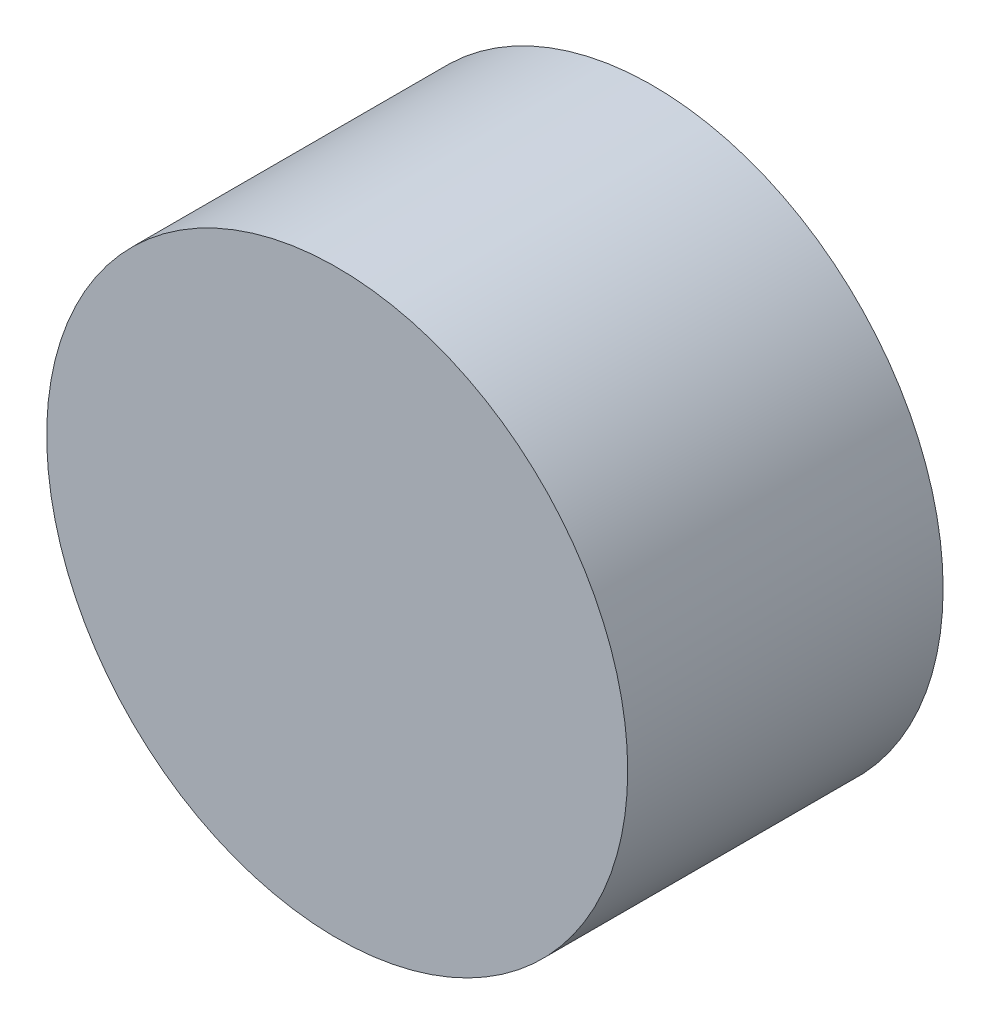
ISO-10303-21;
HEADER;
FILE_DESCRIPTION(('STEP AP214'),'2;1');
FILE_NAME('part.step','',(''),(''),'','','');
FILE_SCHEMA(('AUTOMOTIVE_DESIGN { 1 0 10303 214 1 1 1 1 }'));
ENDSEC;
DATA;
#1=APPLICATION_CONTEXT('core data for automotive mechanical design processes');
#2=APPLICATION_PROTOCOL_DEFINITION('international standard','automotive_design',2000,#1);
#3=PRODUCT_CONTEXT('',#1,'mechanical');
#4=PRODUCT('Part','Part','',(#3));
#5=PRODUCT_RELATED_PRODUCT_CATEGORY('part','',(#4));
#6=PRODUCT_DEFINITION_FORMATION('','',#4);
#7=PRODUCT_DEFINITION_CONTEXT('part definition',#1,'design');
#8=PRODUCT_DEFINITION('design','',#6,#7);
#9=PRODUCT_DEFINITION_SHAPE('','',#8);
#10=(LENGTH_UNIT() NAMED_UNIT(*) SI_UNIT(.MILLI.,.METRE.));
#11=(NAMED_UNIT(*) PLANE_ANGLE_UNIT() SI_UNIT($,.RADIAN.));
#12=(NAMED_UNIT(*) SI_UNIT($,.STERADIAN.) SOLID_ANGLE_UNIT());
#13=UNCERTAINTY_MEASURE_WITH_UNIT(LENGTH_MEASURE(1.E-05),#10,'distance_accuracy_value','');
#14=(GEOMETRIC_REPRESENTATION_CONTEXT(3) GLOBAL_UNCERTAINTY_ASSIGNED_CONTEXT((#13)) GLOBAL_UNIT_ASSIGNED_CONTEXT((#10,
#11,#12)) REPRESENTATION_CONTEXT('',''));
#15=CARTESIAN_POINT('',(0.,0.,0.));
#16=DIRECTION('',(0.,0.,1.));
#17=DIRECTION('',(1.,0.,0.));
#18=AXIS2_PLACEMENT_3D('',#15,#16,#17);
#19=CARTESIAN_POINT('',(86.6025403784442,-14.9999999999995,-19.));
#20=DIRECTION('',(0.,0.,1.));
#21=DIRECTION('',(1.,0.,0.));
#22=AXIS2_PLACEMENT_3D('',#19,#20,#21);
#23=CYLINDRICAL_SURFACE('',#22,17.5);
#24=CARTESIAN_POINT('',(86.6025403784442,-14.9999999999995,-19.));
#25=DIRECTION('',(0.,0.,1.));
#26=DIRECTION('',(1.,0.,0.));
#27=AXIS2_PLACEMENT_3D('',#24,#25,#26);
#28=CIRCLE('',#27,17.5);
#29=CARTESIAN_POINT('',(104.102540378444,-14.9999999999995,-19.));
#30=VERTEX_POINT('',#29);
#31=EDGE_CURVE('E10',#30,#30,#28,.T.);
#32=ORIENTED_EDGE('',*,*,#31,.T.);
#33=EDGE_LOOP('',(#32));
#34=FACE_BOUND('',#33,.T.);
#35=CARTESIAN_POINT('',(86.6025403784442,-14.9999999999995,0.));
#36=DIRECTION('',(0.,0.,1.));
#37=DIRECTION('',(1.,0.,0.));
#38=AXIS2_PLACEMENT_3D('',#35,#36,#37);
#39=CIRCLE('',#38,17.5);
#40=CARTESIAN_POINT('',(104.102540378444,-14.9999999999995,0.));
#41=VERTEX_POINT('',#40);
#42=EDGE_CURVE('E35',#41,#41,#39,.T.);
#43=ORIENTED_EDGE('',*,*,#42,.F.);
#44=EDGE_LOOP('',(#43));
#45=FACE_BOUND('',#44,.T.);
#46=ADVANCED_FACE('F32',(#34,#45),#23,.T.);
#47=CARTESIAN_POINT('',(86.6025403784442,-14.9999999999995,-19.));
#48=DIRECTION('',(0.,0.,1.));
#49=DIRECTION('',(1.,0.,0.));
#50=AXIS2_PLACEMENT_3D('',#47,#48,#49);
#51=PLANE('',#50);
#52=CARTESIAN_POINT('',(86.6025403784442,-14.9999999999995,-19.));
#53=DIRECTION('',(0.,0.,-1.));
#54=DIRECTION('',(-1.,0.,0.));
#55=AXIS2_PLACEMENT_3D('',#52,#53,#54);
#56=CIRCLE('',#55,16.5);
#57=CARTESIAN_POINT('',(70.1025403784442,-14.9999999999995,-19.));
#58=VERTEX_POINT('',#57);
#59=EDGE_CURVE('E44',#58,#58,#56,.T.);
#60=ORIENTED_EDGE('',*,*,#59,.F.);
#61=EDGE_LOOP('',(#60));
#62=FACE_BOUND('',#61,.T.);
#63=ORIENTED_EDGE('',*,*,#31,.F.);
#64=EDGE_LOOP('',(#63));
#65=FACE_BOUND('',#64,.T.);
#66=ADVANCED_FACE('F59',(#62,#65),#51,.F.);
#67=CARTESIAN_POINT('',(86.6025403784442,-14.9999999999995,0.));
#68=DIRECTION('',(0.,0.,1.));
#69=DIRECTION('',(1.,0.,0.));
#70=AXIS2_PLACEMENT_3D('',#67,#68,#69);
#71=PLANE('',#70);
#72=ORIENTED_EDGE('',*,*,#42,.T.);
#73=EDGE_LOOP('',(#72));
#74=FACE_BOUND('',#73,.T.);
#75=ADVANCED_FACE('F55',(#74),#71,.T.);
#76=CARTESIAN_POINT('',(86.6025403784442,-14.9999999999995,-4.));
#77=DIRECTION('',(0.,0.,-1.));
#78=DIRECTION('',(-1.,0.,0.));
#79=AXIS2_PLACEMENT_3D('',#76,#77,#78);
#80=CYLINDRICAL_SURFACE('',#79,16.5);
#81=CARTESIAN_POINT('',(86.6025403784442,-14.9999999999995,-4.));
#82=DIRECTION('',(0.,0.,-1.));
#83=DIRECTION('',(-1.,0.,0.));
#84=AXIS2_PLACEMENT_3D('',#81,#82,#83);
#85=CIRCLE('',#84,16.5);
#86=CARTESIAN_POINT('',(70.1025403784442,-14.9999999999995,-4.));
#87=VERTEX_POINT('',#86);
#88=EDGE_CURVE('E42',#87,#87,#85,.T.);
#89=ORIENTED_EDGE('',*,*,#88,.F.);
#90=EDGE_LOOP('',(#89));
#91=FACE_BOUND('',#90,.T.);
#92=ORIENTED_EDGE('',*,*,#59,.T.);
#93=EDGE_LOOP('',(#92));
#94=FACE_BOUND('',#93,.T.);
#95=ADVANCED_FACE('F52',(#91,#94),#80,.F.);
#96=CARTESIAN_POINT('',(86.6025403784442,-14.9999999999995,-4.));
#97=DIRECTION('',(0.,0.,-1.));
#98=DIRECTION('',(-1.,0.,0.));
#99=AXIS2_PLACEMENT_3D('',#96,#97,#98);
#100=PLANE('',#99);
#101=ORIENTED_EDGE('',*,*,#88,.T.);
#102=EDGE_LOOP('',(#101));
#103=FACE_BOUND('',#102,.T.);
#104=ADVANCED_FACE('F50',(#103),#100,.T.);
#105=CLOSED_SHELL('',(#46,#66,#75,#95,#104));
#106=MANIFOLD_SOLID_BREP('B2',#105);
#107=ADVANCED_BREP_SHAPE_REPRESENTATION('',(#18,#106),#14);
#108=SHAPE_DEFINITION_REPRESENTATION(#9,#107);
ENDSEC;
END-ISO-10303-21;
